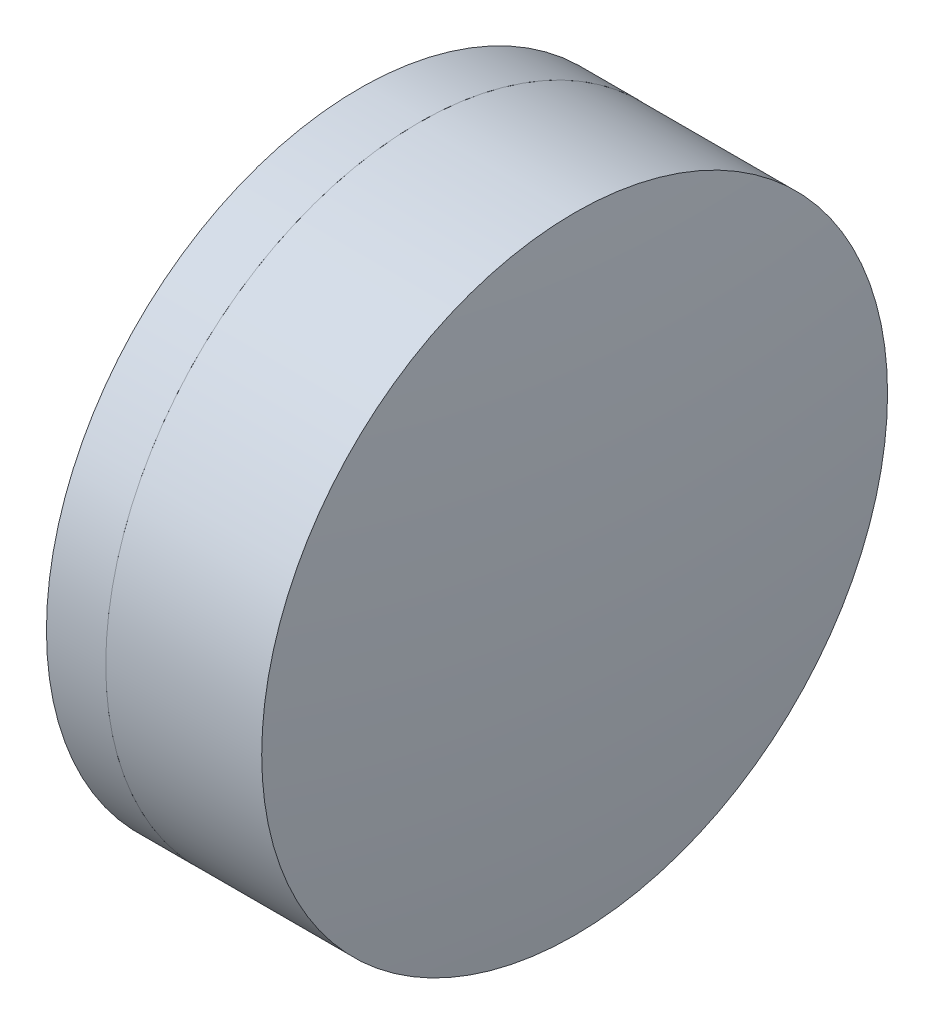
ISO-10303-21;
HEADER;
FILE_DESCRIPTION(('STEP AP214'),'2;1');
FILE_NAME('part.step','',(''),(''),'','','');
FILE_SCHEMA(('AUTOMOTIVE_DESIGN { 1 0 10303 214 1 1 1 1 }'));
ENDSEC;
DATA;
#1=APPLICATION_CONTEXT('core data for automotive mechanical design processes');
#2=APPLICATION_PROTOCOL_DEFINITION('international standard','automotive_design',2000,#1);
#3=PRODUCT_CONTEXT('',#1,'mechanical');
#4=PRODUCT('Part','Part','',(#3));
#5=PRODUCT_RELATED_PRODUCT_CATEGORY('part','',(#4));
#6=PRODUCT_DEFINITION_FORMATION('','',#4);
#7=PRODUCT_DEFINITION_CONTEXT('part definition',#1,'design');
#8=PRODUCT_DEFINITION('design','',#6,#7);
#9=PRODUCT_DEFINITION_SHAPE('','',#8);
#10=(LENGTH_UNIT() NAMED_UNIT(*) SI_UNIT(.MILLI.,.METRE.));
#11=(NAMED_UNIT(*) PLANE_ANGLE_UNIT() SI_UNIT($,.RADIAN.));
#12=(NAMED_UNIT(*) SI_UNIT($,.STERADIAN.) SOLID_ANGLE_UNIT());
#13=UNCERTAINTY_MEASURE_WITH_UNIT(LENGTH_MEASURE(1.E-05),#10,'distance_accuracy_value','');
#14=(GEOMETRIC_REPRESENTATION_CONTEXT(3) GLOBAL_UNCERTAINTY_ASSIGNED_CONTEXT((#13)) GLOBAL_UNIT_ASSIGNED_CONTEXT((#10,
#11,#12)) REPRESENTATION_CONTEXT('',''));
#15=CARTESIAN_POINT('',(0.,0.,0.));
#16=DIRECTION('',(0.,0.,1.));
#17=DIRECTION('',(1.,0.,0.));
#18=AXIS2_PLACEMENT_3D('',#15,#16,#17);
#19=CARTESIAN_POINT('',(8.33023858577234,0.,0.));
#20=DIRECTION('',(-1.,0.,0.));
#21=DIRECTION('',(0.,0.,-1.));
#22=AXIS2_PLACEMENT_3D('',#19,#20,#21);
#23=SPHERICAL_SURFACE('',#22,17.87);
#24=CARTESIAN_POINT('',(20.9019091191581,0.,0.));
#25=DIRECTION('',(-1.,0.,0.));
#26=DIRECTION('',(0.,0.,1.));
#27=AXIS2_PLACEMENT_3D('',#24,#25,#26);
#28=CIRCLE('',#27,12.7);
#29=CARTESIAN_POINT('',(20.9019091191581,0.,12.7));
#30=VERTEX_POINT('',#29);
#31=EDGE_CURVE('E51',#30,#30,#28,.T.);
#32=ORIENTED_EDGE('',*,*,#31,.T.);
#33=EDGE_LOOP('',(#32));
#34=FACE_BOUND('',#33,.T.);
#35=ADVANCED_FACE('F45',(#34),#23,.F.);
#36=CARTESIAN_POINT('',(-77.1997614142277,0.,0.));
#37=DIRECTION('',(-1.,0.,0.));
#38=DIRECTION('',(0.,0.,-1.));
#39=AXIS2_PLACEMENT_3D('',#36,#37,#38);
#40=SPHERICAL_SURFACE('',#39,105.2);
#41=CARTESIAN_POINT('',(27.2308375498691,0.,0.));
#42=DIRECTION('',(-1.,0.,0.));
#43=DIRECTION('',(0.,0.,1.));
#44=AXIS2_PLACEMENT_3D('',#41,#42,#43);
#45=CIRCLE('',#44,12.7);
#46=CARTESIAN_POINT('',(27.2308375498691,0.,12.7));
#47=VERTEX_POINT('',#46);
#48=EDGE_CURVE('E11',#47,#47,#45,.T.);
#49=ORIENTED_EDGE('',*,*,#48,.F.);
#50=EDGE_LOOP('',(#49));
#51=FACE_BOUND('',#50,.T.);
#52=ADVANCED_FACE('F60',(#51),#40,.T.);
#53=CARTESIAN_POINT('',(-0.551919992657797,0.,0.));
#54=DIRECTION('',(-1.,0.,0.));
#55=DIRECTION('',(0.,0.,1.));
#56=AXIS2_PLACEMENT_3D('',#53,#54,#55);
#57=CYLINDRICAL_SURFACE('',#56,12.7);
#58=ORIENTED_EDGE('',*,*,#48,.T.);
#59=EDGE_LOOP('',(#58));
#60=FACE_BOUND('',#59,.T.);
#61=ORIENTED_EDGE('',*,*,#31,.F.);
#62=EDGE_LOOP('',(#61));
#63=FACE_BOUND('',#62,.T.);
#64=ADVANCED_FACE('F58',(#60,#63),#57,.T.);
#65=CLOSED_SHELL('',(#35,#52,#64));
#66=MANIFOLD_SOLID_BREP('B2',#65);
#67=CARTESIAN_POINT('',(37.8502385857723,0.,0.));
#68=DIRECTION('',(-1.,0.,0.));
#69=DIRECTION('',(0.,0.,1.));
#70=AXIS2_PLACEMENT_3D('',#67,#68,#69);
#71=SPHERICAL_SURFACE('',#70,23.15);
#72=CARTESIAN_POINT('',(18.4948129898315,0.,0.));
#73=DIRECTION('',(-1.,0.,0.));
#74=DIRECTION('',(0.,0.,1.));
#75=AXIS2_PLACEMENT_3D('',#72,#73,#74);
#76=CIRCLE('',#75,12.7);
#77=CARTESIAN_POINT('',(18.4948129898315,0.,12.7));
#78=VERTEX_POINT('',#77);
#79=EDGE_CURVE('E44',#78,#78,#76,.T.);
#80=ORIENTED_EDGE('',*,*,#79,.T.);
#81=EDGE_LOOP('',(#80));
#82=FACE_BOUND('',#81,.T.);
#83=ADVANCED_FACE('F86',(#82),#71,.T.);
#84=CARTESIAN_POINT('',(-0.816062176165804,0.,0.));
#85=DIRECTION('',(-1.,0.,0.));
#86=DIRECTION('',(0.,0.,1.));
#87=AXIS2_PLACEMENT_3D('',#84,#85,#86);
#88=CYLINDRICAL_SURFACE('',#87,12.7);
#89=CARTESIAN_POINT('',(20.9019091191581,0.,0.));
#90=DIRECTION('',(-1.,0.,0.));
#91=DIRECTION('',(0.,0.,1.));
#92=AXIS2_PLACEMENT_3D('',#89,#90,#91);
#93=CIRCLE('',#92,12.7);
#94=CARTESIAN_POINT('',(20.9019091191581,0.,12.7));
#95=VERTEX_POINT('',#94);
#96=EDGE_CURVE('E92',#95,#95,#93,.T.);
#97=ORIENTED_EDGE('',*,*,#96,.T.);
#98=EDGE_LOOP('',(#97));
#99=FACE_BOUND('',#98,.T.);
#100=ORIENTED_EDGE('',*,*,#79,.F.);
#101=EDGE_LOOP('',(#100));
#102=FACE_BOUND('',#101,.T.);
#103=ADVANCED_FACE('F98',(#99,#102),#88,.T.);
#104=CARTESIAN_POINT('',(8.33023858577234,0.,0.));
#105=DIRECTION('',(-1.,0.,0.));
#106=DIRECTION('',(0.,0.,1.));
#107=AXIS2_PLACEMENT_3D('',#104,#105,#106);
#108=SPHERICAL_SURFACE('',#107,17.87);
#109=ORIENTED_EDGE('',*,*,#96,.F.);
#110=EDGE_LOOP('',(#109));
#111=FACE_BOUND('',#110,.T.);
#112=ADVANCED_FACE('F101',(#111),#108,.T.);
#113=CLOSED_SHELL('',(#83,#103,#112));
#114=MANIFOLD_SOLID_BREP('B6',#113);
#115=ADVANCED_BREP_SHAPE_REPRESENTATION('',(#18,#66,#114),#14);
#116=SHAPE_DEFINITION_REPRESENTATION(#9,#115);
ENDSEC;
END-ISO-10303-21;
